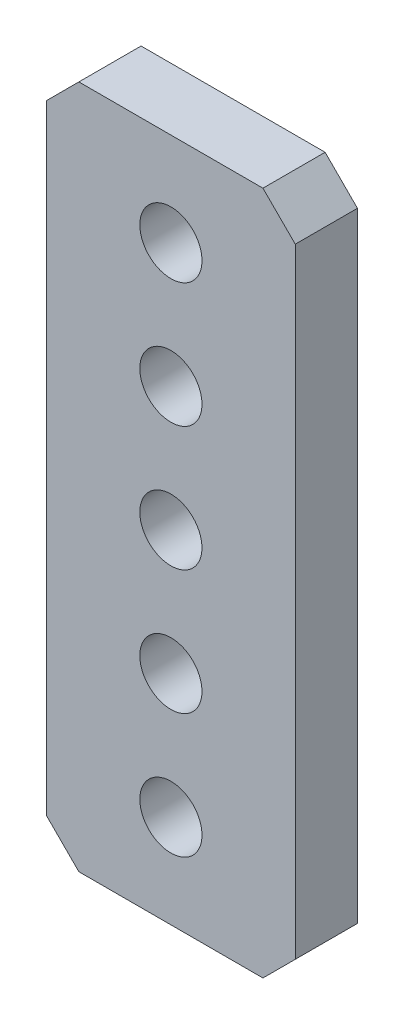
ISO-10303-21;
HEADER;
FILE_DESCRIPTION(('STEP AP214'),'2;1');
FILE_NAME('part.step','',(''),(''),'','','');
FILE_SCHEMA(('AUTOMOTIVE_DESIGN { 1 0 10303 214 1 1 1 1 }'));
ENDSEC;
DATA;
#1=APPLICATION_CONTEXT('core data for automotive mechanical design processes');
#2=APPLICATION_PROTOCOL_DEFINITION('international standard','automotive_design',2000,#1);
#3=PRODUCT_CONTEXT('',#1,'mechanical');
#4=PRODUCT('Part','Part','',(#3));
#5=PRODUCT_RELATED_PRODUCT_CATEGORY('part','',(#4));
#6=PRODUCT_DEFINITION_FORMATION('','',#4);
#7=PRODUCT_DEFINITION_CONTEXT('part definition',#1,'design');
#8=PRODUCT_DEFINITION('design','',#6,#7);
#9=PRODUCT_DEFINITION_SHAPE('','',#8);
#10=(LENGTH_UNIT() NAMED_UNIT(*) SI_UNIT(.MILLI.,.METRE.));
#11=(NAMED_UNIT(*) PLANE_ANGLE_UNIT() SI_UNIT($,.RADIAN.));
#12=(NAMED_UNIT(*) SI_UNIT($,.STERADIAN.) SOLID_ANGLE_UNIT());
#13=UNCERTAINTY_MEASURE_WITH_UNIT(LENGTH_MEASURE(1.E-05),#10,'distance_accuracy_value','');
#14=(GEOMETRIC_REPRESENTATION_CONTEXT(3) GLOBAL_UNCERTAINTY_ASSIGNED_CONTEXT((#13)) GLOBAL_UNIT_ASSIGNED_CONTEXT((#10,
#11,#12)) REPRESENTATION_CONTEXT('',''));
#15=CARTESIAN_POINT('',(0.,0.,0.));
#16=DIRECTION('',(0.,0.,1.));
#17=DIRECTION('',(1.,0.,0.));
#18=AXIS2_PLACEMENT_3D('',#15,#16,#17);
#19=CARTESIAN_POINT('',(0.,0.,3.175));
#20=DIRECTION('',(0.,0.,1.));
#21=DIRECTION('',(1.,0.,0.));
#22=AXIS2_PLACEMENT_3D('',#19,#20,#21);
#23=PLANE('',#22);
#24=DIRECTION('',(0.,1.,0.));
#25=VECTOR('',#24,1.);
#26=CARTESIAN_POINT('',(-6.35,47.625,3.175));
#27=LINE('',#26,#25);
#28=CARTESIAN_POINT('',(-6.35,45.974,3.175));
#29=VERTEX_POINT('',#28);
#30=CARTESIAN_POINT('',(-6.35,14.3509999999999,3.175));
#31=VERTEX_POINT('',#30);
#32=EDGE_CURVE('E336',#29,#31,#27,.F.);
#33=ORIENTED_EDGE('',*,*,#32,.T.);
#34=DIRECTION('',(0.707106781186548,-0.707106781186547,0.));
#35=VECTOR('',#34,1.);
#36=CARTESIAN_POINT('',(-6.35,14.3509999999999,3.175));
#37=LINE('',#36,#35);
#38=CARTESIAN_POINT('',(-4.69900000000008,12.7,3.175));
#39=VERTEX_POINT('',#38);
#40=EDGE_CURVE('E334',#39,#31,#37,.F.);
#41=ORIENTED_EDGE('',*,*,#40,.F.);
#42=DIRECTION('',(1.,0.,0.));
#43=VECTOR('',#42,1.);
#44=CARTESIAN_POINT('',(-6.35000000000008,12.7,3.175));
#45=LINE('',#44,#43);
#46=CARTESIAN_POINT('',(4.699,12.7,3.175));
#47=VERTEX_POINT('',#46);
#48=EDGE_CURVE('E330',#47,#39,#45,.F.);
#49=ORIENTED_EDGE('',*,*,#48,.F.);
#50=DIRECTION('',(0.707106781186547,0.707106781186548,0.));
#51=VECTOR('',#50,1.);
#52=CARTESIAN_POINT('',(4.69899999999999,12.7,3.175));
#53=LINE('',#52,#51);
#54=CARTESIAN_POINT('',(6.35,14.351,3.175));
#55=VERTEX_POINT('',#54);
#56=EDGE_CURVE('E326',#55,#47,#53,.F.);
#57=ORIENTED_EDGE('',*,*,#56,.F.);
#58=DIRECTION('',(0.,-1.,0.));
#59=VECTOR('',#58,1.);
#60=CARTESIAN_POINT('',(6.34999999999999,9.52499999999999,3.175));
#61=LINE('',#60,#59);
#62=CARTESIAN_POINT('',(6.35,45.974,3.175));
#63=VERTEX_POINT('',#62);
#64=EDGE_CURVE('E85',#55,#63,#61,.F.);
#65=ORIENTED_EDGE('',*,*,#64,.T.);
#66=DIRECTION('',(0.707106781186548,-0.707106781186548,0.));
#67=VECTOR('',#66,1.);
#68=CARTESIAN_POINT('',(4.69899999999999,47.625,3.175));
#69=LINE('',#68,#67);
#70=CARTESIAN_POINT('',(4.69899999999999,47.625,3.175));
#71=VERTEX_POINT('',#70);
#72=EDGE_CURVE('E82',#63,#71,#69,.F.);
#73=ORIENTED_EDGE('',*,*,#72,.T.);
#74=DIRECTION('',(1.,0.,0.));
#75=VECTOR('',#74,1.);
#76=CARTESIAN_POINT('',(6.35,47.625,3.175));
#77=LINE('',#76,#75);
#78=CARTESIAN_POINT('',(-4.69899999999999,47.625,3.175));
#79=VERTEX_POINT('',#78);
#80=EDGE_CURVE('E79',#71,#79,#77,.F.);
#81=ORIENTED_EDGE('',*,*,#80,.T.);
#82=DIRECTION('',(0.707106781186549,0.707106781186546,0.));
#83=VECTOR('',#82,1.);
#84=CARTESIAN_POINT('',(-6.35,45.974,3.175));
#85=LINE('',#84,#83);
#86=EDGE_CURVE('E309',#79,#29,#85,.F.);
#87=ORIENTED_EDGE('',*,*,#86,.T.);
#88=EDGE_LOOP('',(#33,#41,#49,#57,#65,#73,#81,#87));
#89=FACE_BOUND('',#88,.T.);
#90=CARTESIAN_POINT('',(0.,36.5125,3.175));
#91=DIRECTION('',(0.,0.,-1.));
#92=DIRECTION('',(-1.,0.,0.));
#93=AXIS2_PLACEMENT_3D('',#90,#91,#92);
#94=CIRCLE('',#93,1.5875);
#95=CARTESIAN_POINT('',(-1.58750000000007,36.5125,3.175));
#96=VERTEX_POINT('',#95);
#97=EDGE_CURVE('E128',#96,#96,#94,.T.);
#98=ORIENTED_EDGE('',*,*,#97,.T.);
#99=EDGE_LOOP('',(#98));
#100=FACE_BOUND('',#99,.T.);
#101=CARTESIAN_POINT('',(0.,23.8125,3.175));
#102=DIRECTION('',(0.,0.,-1.));
#103=DIRECTION('',(-1.,0.,0.));
#104=AXIS2_PLACEMENT_3D('',#101,#102,#103);
#105=CIRCLE('',#104,1.5875);
#106=CARTESIAN_POINT('',(-1.58750000000002,23.8125,3.175));
#107=VERTEX_POINT('',#106);
#108=EDGE_CURVE('E123',#107,#107,#105,.T.);
#109=ORIENTED_EDGE('',*,*,#108,.T.);
#110=EDGE_LOOP('',(#109));
#111=FACE_BOUND('',#110,.T.);
#112=CARTESIAN_POINT('',(0.,17.4625,3.175));
#113=DIRECTION('',(0.,0.,-1.));
#114=DIRECTION('',(-1.,0.,0.));
#115=AXIS2_PLACEMENT_3D('',#112,#113,#114);
#116=CIRCLE('',#115,1.5875);
#117=CARTESIAN_POINT('',(-1.5875,17.4625,3.175));
#118=VERTEX_POINT('',#117);
#119=EDGE_CURVE('E91',#118,#118,#116,.T.);
#120=ORIENTED_EDGE('',*,*,#119,.T.);
#121=EDGE_LOOP('',(#120));
#122=FACE_BOUND('',#121,.T.);
#123=CARTESIAN_POINT('',(0.,30.1625,3.175));
#124=DIRECTION('',(0.,0.,-1.));
#125=DIRECTION('',(-1.,0.,0.));
#126=AXIS2_PLACEMENT_3D('',#123,#124,#125);
#127=CIRCLE('',#126,1.5875);
#128=CARTESIAN_POINT('',(-1.58750000000004,30.1625,3.175));
#129=VERTEX_POINT('',#128);
#130=EDGE_CURVE('E126',#129,#129,#127,.T.);
#131=ORIENTED_EDGE('',*,*,#130,.T.);
#132=EDGE_LOOP('',(#131));
#133=FACE_BOUND('',#132,.T.);
#134=CARTESIAN_POINT('',(0.,42.8625,3.175));
#135=DIRECTION('',(0.,0.,-1.));
#136=DIRECTION('',(-1.,0.,0.));
#137=AXIS2_PLACEMENT_3D('',#134,#135,#136);
#138=CIRCLE('',#137,1.5875);
#139=CARTESIAN_POINT('',(-1.58750000000009,42.8625,3.175));
#140=VERTEX_POINT('',#139);
#141=EDGE_CURVE('E20',#140,#140,#138,.T.);
#142=ORIENTED_EDGE('',*,*,#141,.T.);
#143=EDGE_LOOP('',(#142));
#144=FACE_BOUND('',#143,.T.);
#145=ADVANCED_FACE('F17',(#89,#100,#111,#122,#133,#144),#23,.T.);
#146=CARTESIAN_POINT('',(0.,42.8625,3.175));
#147=DIRECTION('',(0.,0.,-1.));
#148=DIRECTION('',(-1.,0.,0.));
#149=AXIS2_PLACEMENT_3D('',#146,#147,#148);
#150=CYLINDRICAL_SURFACE('',#149,1.5875);
#151=CARTESIAN_POINT('',(0.,42.8625,0.));
#152=DIRECTION('',(0.,0.,-1.));
#153=DIRECTION('',(-1.,0.,0.));
#154=AXIS2_PLACEMENT_3D('',#151,#152,#153);
#155=CIRCLE('',#154,1.5875);
#156=CARTESIAN_POINT('',(-1.58750000000009,42.8625,0.));
#157=VERTEX_POINT('',#156);
#158=EDGE_CURVE('E118',#157,#157,#155,.T.);
#159=ORIENTED_EDGE('',*,*,#158,.T.);
#160=EDGE_LOOP('',(#159));
#161=FACE_BOUND('',#160,.T.);
#162=ORIENTED_EDGE('',*,*,#141,.F.);
#163=EDGE_LOOP('',(#162));
#164=FACE_BOUND('',#163,.T.);
#165=ADVANCED_FACE('F135',(#161,#164),#150,.F.);
#166=CARTESIAN_POINT('',(0.,36.5125,3.175));
#167=DIRECTION('',(0.,0.,-1.));
#168=DIRECTION('',(-1.,0.,0.));
#169=AXIS2_PLACEMENT_3D('',#166,#167,#168);
#170=CYLINDRICAL_SURFACE('',#169,1.5875);
#171=CARTESIAN_POINT('',(0.,36.5125,0.));
#172=DIRECTION('',(0.,0.,-1.));
#173=DIRECTION('',(-1.,0.,0.));
#174=AXIS2_PLACEMENT_3D('',#171,#172,#173);
#175=CIRCLE('',#174,1.5875);
#176=CARTESIAN_POINT('',(-1.58750000000007,36.5125,0.));
#177=VERTEX_POINT('',#176);
#178=EDGE_CURVE('E115',#177,#177,#175,.T.);
#179=ORIENTED_EDGE('',*,*,#178,.T.);
#180=EDGE_LOOP('',(#179));
#181=FACE_BOUND('',#180,.T.);
#182=ORIENTED_EDGE('',*,*,#97,.F.);
#183=EDGE_LOOP('',(#182));
#184=FACE_BOUND('',#183,.T.);
#185=ADVANCED_FACE('F137',(#181,#184),#170,.F.);
#186=CARTESIAN_POINT('',(0.,30.1625,3.175));
#187=DIRECTION('',(0.,0.,-1.));
#188=DIRECTION('',(-1.,0.,0.));
#189=AXIS2_PLACEMENT_3D('',#186,#187,#188);
#190=CYLINDRICAL_SURFACE('',#189,1.5875);
#191=CARTESIAN_POINT('',(0.,30.1625,0.));
#192=DIRECTION('',(0.,0.,-1.));
#193=DIRECTION('',(-1.,0.,0.));
#194=AXIS2_PLACEMENT_3D('',#191,#192,#193);
#195=CIRCLE('',#194,1.5875);
#196=CARTESIAN_POINT('',(-1.58750000000004,30.1625,0.));
#197=VERTEX_POINT('',#196);
#198=EDGE_CURVE('E112',#197,#197,#195,.T.);
#199=ORIENTED_EDGE('',*,*,#198,.T.);
#200=EDGE_LOOP('',(#199));
#201=FACE_BOUND('',#200,.T.);
#202=ORIENTED_EDGE('',*,*,#130,.F.);
#203=EDGE_LOOP('',(#202));
#204=FACE_BOUND('',#203,.T.);
#205=ADVANCED_FACE('F144',(#201,#204),#190,.F.);
#206=CARTESIAN_POINT('',(0.,23.8125,3.175));
#207=DIRECTION('',(0.,0.,-1.));
#208=DIRECTION('',(-1.,0.,0.));
#209=AXIS2_PLACEMENT_3D('',#206,#207,#208);
#210=CYLINDRICAL_SURFACE('',#209,1.5875);
#211=CARTESIAN_POINT('',(0.,23.8125,0.));
#212=DIRECTION('',(0.,0.,-1.));
#213=DIRECTION('',(-1.,0.,0.));
#214=AXIS2_PLACEMENT_3D('',#211,#212,#213);
#215=CIRCLE('',#214,1.5875);
#216=CARTESIAN_POINT('',(-1.58750000000002,23.8125,0.));
#217=VERTEX_POINT('',#216);
#218=EDGE_CURVE('E109',#217,#217,#215,.T.);
#219=ORIENTED_EDGE('',*,*,#218,.T.);
#220=EDGE_LOOP('',(#219));
#221=FACE_BOUND('',#220,.T.);
#222=ORIENTED_EDGE('',*,*,#108,.F.);
#223=EDGE_LOOP('',(#222));
#224=FACE_BOUND('',#223,.T.);
#225=ADVANCED_FACE('F186',(#221,#224),#210,.F.);
#226=CARTESIAN_POINT('',(0.,17.4625,3.175));
#227=DIRECTION('',(0.,0.,-1.));
#228=DIRECTION('',(-1.,0.,0.));
#229=AXIS2_PLACEMENT_3D('',#226,#227,#228);
#230=CYLINDRICAL_SURFACE('',#229,1.5875);
#231=CARTESIAN_POINT('',(0.,17.4625,0.));
#232=DIRECTION('',(0.,0.,-1.));
#233=DIRECTION('',(-1.,0.,0.));
#234=AXIS2_PLACEMENT_3D('',#231,#232,#233);
#235=CIRCLE('',#234,1.5875);
#236=CARTESIAN_POINT('',(-1.5875,17.4625,0.));
#237=VERTEX_POINT('',#236);
#238=EDGE_CURVE('E106',#237,#237,#235,.T.);
#239=ORIENTED_EDGE('',*,*,#238,.T.);
#240=EDGE_LOOP('',(#239));
#241=FACE_BOUND('',#240,.T.);
#242=ORIENTED_EDGE('',*,*,#119,.F.);
#243=EDGE_LOOP('',(#242));
#244=FACE_BOUND('',#243,.T.);
#245=ADVANCED_FACE('F183',(#241,#244),#230,.F.);
#246=CARTESIAN_POINT('',(4.69899999999999,47.625,3.175));
#247=DIRECTION('',(-0.707106781186548,-0.707106781186548,0.));
#248=DIRECTION('',(0.707106781186548,-0.707106781186548,0.));
#249=AXIS2_PLACEMENT_3D('',#246,#247,#248);
#250=PLANE('',#249);
#251=DIRECTION('',(0.,0.,1.));
#252=VECTOR('',#251,1.);
#253=CARTESIAN_POINT('',(6.35,45.974,3.175));
#254=LINE('',#253,#252);
#255=CARTESIAN_POINT('',(6.35,45.974,0.));
#256=VERTEX_POINT('',#255);
#257=EDGE_CURVE('E322',#63,#256,#254,.F.);
#258=ORIENTED_EDGE('',*,*,#257,.T.);
#259=DIRECTION('',(-0.707106781186547,0.707106781186547,0.));
#260=VECTOR('',#259,1.);
#261=CARTESIAN_POINT('',(6.35,45.974,0.));
#262=LINE('',#261,#260);
#263=CARTESIAN_POINT('',(4.69899999999999,47.625,0.));
#264=VERTEX_POINT('',#263);
#265=EDGE_CURVE('E102',#256,#264,#262,.T.);
#266=ORIENTED_EDGE('',*,*,#265,.T.);
#267=DIRECTION('',(0.,0.,-1.));
#268=VECTOR('',#267,1.);
#269=CARTESIAN_POINT('',(4.69899999999999,47.625,3.175));
#270=LINE('',#269,#268);
#271=EDGE_CURVE('E90',#264,#71,#270,.F.);
#272=ORIENTED_EDGE('',*,*,#271,.T.);
#273=ORIENTED_EDGE('',*,*,#72,.F.);
#274=EDGE_LOOP('',(#258,#266,#272,#273));
#275=FACE_BOUND('',#274,.T.);
#276=ADVANCED_FACE('F101',(#275),#250,.F.);
#277=CARTESIAN_POINT('',(6.35,47.625,3.175));
#278=DIRECTION('',(0.,-1.,0.));
#279=DIRECTION('',(0.,0.,-1.));
#280=AXIS2_PLACEMENT_3D('',#277,#278,#279);
#281=PLANE('',#280);
#282=DIRECTION('',(0.,0.,1.));
#283=VECTOR('',#282,1.);
#284=CARTESIAN_POINT('',(-4.69899999999999,47.625,3.175));
#285=LINE('',#284,#283);
#286=CARTESIAN_POINT('',(-4.69899999999999,47.625,0.));
#287=VERTEX_POINT('',#286);
#288=EDGE_CURVE('E98',#287,#79,#285,.T.);
#289=ORIENTED_EDGE('',*,*,#288,.T.);
#290=ORIENTED_EDGE('',*,*,#80,.F.);
#291=ORIENTED_EDGE('',*,*,#271,.F.);
#292=DIRECTION('',(1.,0.,0.));
#293=VECTOR('',#292,1.);
#294=CARTESIAN_POINT('',(0.,47.625,0.));
#295=LINE('',#294,#293);
#296=EDGE_CURVE('E311',#264,#287,#295,.F.);
#297=ORIENTED_EDGE('',*,*,#296,.T.);
#298=EDGE_LOOP('',(#289,#290,#291,#297));
#299=FACE_BOUND('',#298,.T.);
#300=ADVANCED_FACE('F95',(#299),#281,.F.);
#301=CARTESIAN_POINT('',(-6.35,45.974,3.175));
#302=DIRECTION('',(0.707106781186546,-0.707106781186549,0.));
#303=DIRECTION('',(0.707106781186549,0.707106781186546,0.));
#304=AXIS2_PLACEMENT_3D('',#301,#302,#303);
#305=PLANE('',#304);
#306=ORIENTED_EDGE('',*,*,#288,.F.);
#307=DIRECTION('',(-0.707106781186549,-0.707106781186546,0.));
#308=VECTOR('',#307,1.);
#309=CARTESIAN_POINT('',(-4.69899999999999,47.625,0.));
#310=LINE('',#309,#308);
#311=CARTESIAN_POINT('',(-6.35,45.974,0.));
#312=VERTEX_POINT('',#311);
#313=EDGE_CURVE('E308',#287,#312,#310,.T.);
#314=ORIENTED_EDGE('',*,*,#313,.T.);
#315=DIRECTION('',(0.,0.,1.));
#316=VECTOR('',#315,1.);
#317=CARTESIAN_POINT('',(-6.35,45.974,3.175));
#318=LINE('',#317,#316);
#319=EDGE_CURVE('E338',#312,#29,#318,.T.);
#320=ORIENTED_EDGE('',*,*,#319,.T.);
#321=ORIENTED_EDGE('',*,*,#86,.F.);
#322=EDGE_LOOP('',(#306,#314,#320,#321));
#323=FACE_BOUND('',#322,.T.);
#324=ADVANCED_FACE('F174',(#323),#305,.F.);
#325=CARTESIAN_POINT('',(-6.35,47.625,3.175));
#326=DIRECTION('',(1.,0.,0.));
#327=DIRECTION('',(0.,1.,0.));
#328=AXIS2_PLACEMENT_3D('',#325,#326,#327);
#329=PLANE('',#328);
#330=DIRECTION('',(0.,0.,1.));
#331=VECTOR('',#330,1.);
#332=CARTESIAN_POINT('',(-6.35,14.3509999999999,3.175));
#333=LINE('',#332,#331);
#334=CARTESIAN_POINT('',(-6.35,14.3509999999999,0.));
#335=VERTEX_POINT('',#334);
#336=EDGE_CURVE('E332',#31,#335,#333,.F.);
#337=ORIENTED_EDGE('',*,*,#336,.F.);
#338=ORIENTED_EDGE('',*,*,#32,.F.);
#339=ORIENTED_EDGE('',*,*,#319,.F.);
#340=DIRECTION('',(0.,1.,0.));
#341=VECTOR('',#340,1.);
#342=CARTESIAN_POINT('',(-6.35,0.,0.));
#343=LINE('',#342,#341);
#344=EDGE_CURVE('E314',#312,#335,#343,.F.);
#345=ORIENTED_EDGE('',*,*,#344,.T.);
#346=EDGE_LOOP('',(#337,#338,#339,#345));
#347=FACE_BOUND('',#346,.T.);
#348=ADVANCED_FACE('F170',(#347),#329,.F.);
#349=CARTESIAN_POINT('',(-6.35,14.3509999999999,3.175));
#350=DIRECTION('',(-0.707106781186547,-0.707106781186548,0.));
#351=DIRECTION('',(0.707106781186548,-0.707106781186547,0.));
#352=AXIS2_PLACEMENT_3D('',#349,#350,#351);
#353=PLANE('',#352);
#354=ORIENTED_EDGE('',*,*,#40,.T.);
#355=ORIENTED_EDGE('',*,*,#336,.T.);
#356=DIRECTION('',(0.707106781186548,-0.707106781186547,0.));
#357=VECTOR('',#356,1.);
#358=CARTESIAN_POINT('',(-6.35,14.3509999999999,0.));
#359=LINE('',#358,#357);
#360=CARTESIAN_POINT('',(-4.69900000000008,12.7,0.));
#361=VERTEX_POINT('',#360);
#362=EDGE_CURVE('E345',#335,#361,#359,.T.);
#363=ORIENTED_EDGE('',*,*,#362,.T.);
#364=DIRECTION('',(0.,0.,-1.));
#365=VECTOR('',#364,1.);
#366=CARTESIAN_POINT('',(-4.69900000000008,12.7,0.));
#367=LINE('',#366,#365);
#368=EDGE_CURVE('E328',#39,#361,#367,.T.);
#369=ORIENTED_EDGE('',*,*,#368,.F.);
#370=EDGE_LOOP('',(#354,#355,#363,#369));
#371=FACE_BOUND('',#370,.T.);
#372=ADVANCED_FACE('F166',(#371),#353,.T.);
#373=CARTESIAN_POINT('',(-6.35000000000008,12.7,0.));
#374=DIRECTION('',(0.,-1.,0.));
#375=DIRECTION('',(0.,0.,-1.));
#376=AXIS2_PLACEMENT_3D('',#373,#374,#375);
#377=PLANE('',#376);
#378=ORIENTED_EDGE('',*,*,#48,.T.);
#379=ORIENTED_EDGE('',*,*,#368,.T.);
#380=DIRECTION('',(1.,0.,0.));
#381=VECTOR('',#380,1.);
#382=CARTESIAN_POINT('',(0.,12.7,0.));
#383=LINE('',#382,#381);
#384=CARTESIAN_POINT('',(4.69899999999999,12.7,0.));
#385=VERTEX_POINT('',#384);
#386=EDGE_CURVE('E348',#361,#385,#383,.T.);
#387=ORIENTED_EDGE('',*,*,#386,.T.);
#388=DIRECTION('',(0.,0.,1.));
#389=VECTOR('',#388,1.);
#390=CARTESIAN_POINT('',(4.69899999999999,12.7,0.));
#391=LINE('',#390,#389);
#392=EDGE_CURVE('E324',#47,#385,#391,.F.);
#393=ORIENTED_EDGE('',*,*,#392,.F.);
#394=EDGE_LOOP('',(#378,#379,#387,#393));
#395=FACE_BOUND('',#394,.T.);
#396=ADVANCED_FACE('F162',(#395),#377,.T.);
#397=CARTESIAN_POINT('',(4.69899999999999,12.7,0.));
#398=DIRECTION('',(0.707106781186548,-0.707106781186547,0.));
#399=DIRECTION('',(0.707106781186547,0.707106781186548,0.));
#400=AXIS2_PLACEMENT_3D('',#397,#398,#399);
#401=PLANE('',#400);
#402=ORIENTED_EDGE('',*,*,#56,.T.);
#403=ORIENTED_EDGE('',*,*,#392,.T.);
#404=DIRECTION('',(0.707106781186547,0.707106781186548,0.));
#405=VECTOR('',#404,1.);
#406=CARTESIAN_POINT('',(4.69899999999999,12.7,0.));
#407=LINE('',#406,#405);
#408=CARTESIAN_POINT('',(6.35,14.351,0.));
#409=VERTEX_POINT('',#408);
#410=EDGE_CURVE('E26',#385,#409,#407,.T.);
#411=ORIENTED_EDGE('',*,*,#410,.T.);
#412=DIRECTION('',(0.,0.,1.));
#413=VECTOR('',#412,1.);
#414=CARTESIAN_POINT('',(6.35,14.351,3.175));
#415=LINE('',#414,#413);
#416=EDGE_CURVE('E34',#409,#55,#415,.T.);
#417=ORIENTED_EDGE('',*,*,#416,.T.);
#418=EDGE_LOOP('',(#402,#403,#411,#417));
#419=FACE_BOUND('',#418,.T.);
#420=ADVANCED_FACE('F155',(#419),#401,.T.);
#421=CARTESIAN_POINT('',(6.34999999999999,9.52499999999999,3.175));
#422=DIRECTION('',(-1.,0.,0.));
#423=DIRECTION('',(0.,-1.,0.));
#424=AXIS2_PLACEMENT_3D('',#421,#422,#423);
#425=PLANE('',#424);
#426=ORIENTED_EDGE('',*,*,#416,.F.);
#427=DIRECTION('',(0.,1.,0.));
#428=VECTOR('',#427,1.);
#429=CARTESIAN_POINT('',(6.35,0.,0.));
#430=LINE('',#429,#428);
#431=EDGE_CURVE('E11',#409,#256,#430,.T.);
#432=ORIENTED_EDGE('',*,*,#431,.T.);
#433=ORIENTED_EDGE('',*,*,#257,.F.);
#434=ORIENTED_EDGE('',*,*,#64,.F.);
#435=EDGE_LOOP('',(#426,#432,#433,#434));
#436=FACE_BOUND('',#435,.T.);
#437=ADVANCED_FACE('F149',(#436),#425,.F.);
#438=CARTESIAN_POINT('',(0.,0.,0.));
#439=DIRECTION('',(0.,0.,1.));
#440=DIRECTION('',(1.,0.,0.));
#441=AXIS2_PLACEMENT_3D('',#438,#439,#440);
#442=PLANE('',#441);
#443=ORIENTED_EDGE('',*,*,#410,.F.);
#444=ORIENTED_EDGE('',*,*,#386,.F.);
#445=ORIENTED_EDGE('',*,*,#362,.F.);
#446=ORIENTED_EDGE('',*,*,#344,.F.);
#447=ORIENTED_EDGE('',*,*,#313,.F.);
#448=ORIENTED_EDGE('',*,*,#296,.F.);
#449=ORIENTED_EDGE('',*,*,#265,.F.);
#450=ORIENTED_EDGE('',*,*,#431,.F.);
#451=EDGE_LOOP('',(#443,#444,#445,#446,#447,#448,#449,#450));
#452=FACE_BOUND('',#451,.T.);
#453=ORIENTED_EDGE('',*,*,#238,.F.);
#454=EDGE_LOOP('',(#453));
#455=FACE_BOUND('',#454,.T.);
#456=ORIENTED_EDGE('',*,*,#218,.F.);
#457=EDGE_LOOP('',(#456));
#458=FACE_BOUND('',#457,.T.);
#459=ORIENTED_EDGE('',*,*,#198,.F.);
#460=EDGE_LOOP('',(#459));
#461=FACE_BOUND('',#460,.T.);
#462=ORIENTED_EDGE('',*,*,#178,.F.);
#463=EDGE_LOOP('',(#462));
#464=FACE_BOUND('',#463,.T.);
#465=ORIENTED_EDGE('',*,*,#158,.F.);
#466=EDGE_LOOP('',(#465));
#467=FACE_BOUND('',#466,.T.);
#468=ADVANCED_FACE('F147',(#452,#455,#458,#461,#464,#467),#442,.F.);
#469=CLOSED_SHELL('',(#145,#165,#185,#205,#225,#245,#276,#300,#324,#348,#372,#396,#420,#437,#468));
#470=MANIFOLD_SOLID_BREP('B1',#469);
#471=ADVANCED_BREP_SHAPE_REPRESENTATION('',(#18,#470),#14);
#472=SHAPE_DEFINITION_REPRESENTATION(#9,#471);
ENDSEC;
END-ISO-10303-21;
